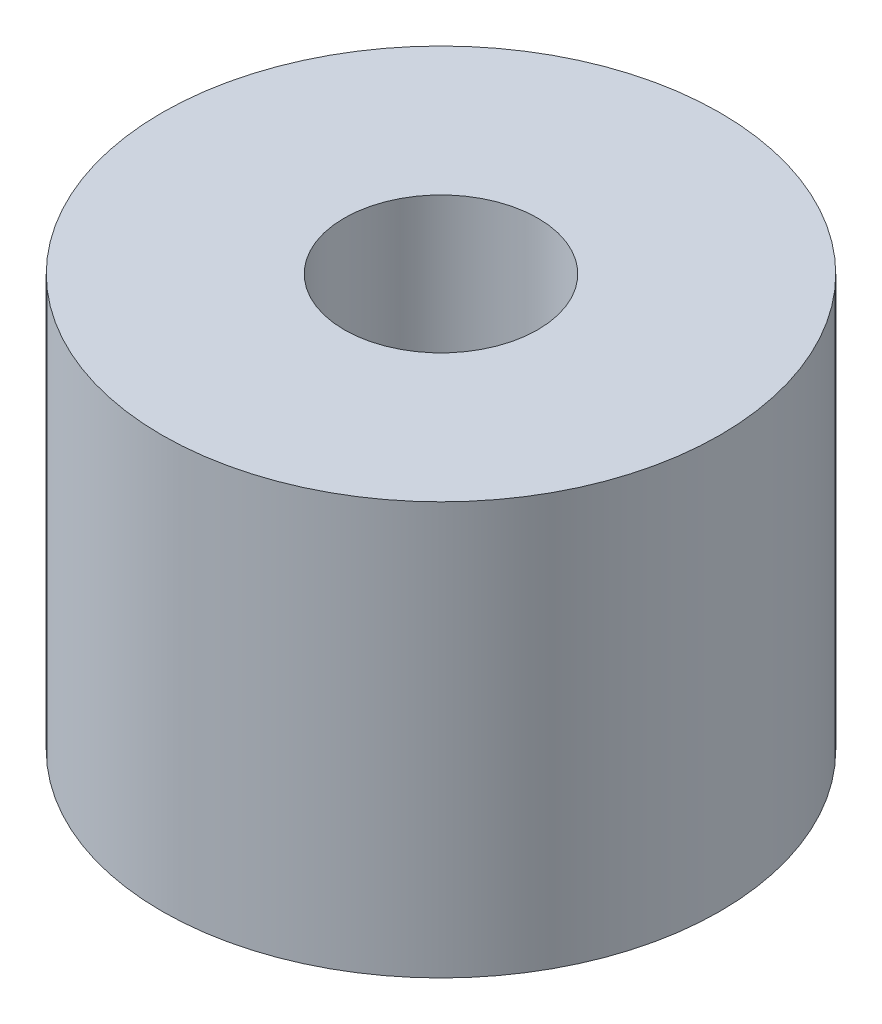
ISO-10303-21;
HEADER;
FILE_DESCRIPTION(('STEP AP214'),'2;1');
FILE_NAME('part.step','',(''),(''),'','','');
FILE_SCHEMA(('AUTOMOTIVE_DESIGN { 1 0 10303 214 1 1 1 1 }'));
ENDSEC;
DATA;
#1=APPLICATION_CONTEXT('core data for automotive mechanical design processes');
#2=APPLICATION_PROTOCOL_DEFINITION('international standard','automotive_design',2000,#1);
#3=PRODUCT_CONTEXT('',#1,'mechanical');
#4=PRODUCT('Part','Part','',(#3));
#5=PRODUCT_RELATED_PRODUCT_CATEGORY('part','',(#4));
#6=PRODUCT_DEFINITION_FORMATION('','',#4);
#7=PRODUCT_DEFINITION_CONTEXT('part definition',#1,'design');
#8=PRODUCT_DEFINITION('design','',#6,#7);
#9=PRODUCT_DEFINITION_SHAPE('','',#8);
#10=(LENGTH_UNIT() NAMED_UNIT(*) SI_UNIT(.MILLI.,.METRE.));
#11=(NAMED_UNIT(*) PLANE_ANGLE_UNIT() SI_UNIT($,.RADIAN.));
#12=(NAMED_UNIT(*) SI_UNIT($,.STERADIAN.) SOLID_ANGLE_UNIT());
#13=UNCERTAINTY_MEASURE_WITH_UNIT(LENGTH_MEASURE(1.E-05),#10,'distance_accuracy_value','');
#14=(GEOMETRIC_REPRESENTATION_CONTEXT(3) GLOBAL_UNCERTAINTY_ASSIGNED_CONTEXT((#13)) GLOBAL_UNIT_ASSIGNED_CONTEXT((#10,
#11,#12)) REPRESENTATION_CONTEXT('',''));
#15=CARTESIAN_POINT('',(0.,0.,0.));
#16=DIRECTION('',(0.,0.,1.));
#17=DIRECTION('',(1.,0.,0.));
#18=AXIS2_PLACEMENT_3D('',#15,#16,#17);
#19=CARTESIAN_POINT('',(0.,11.08,0.));
#20=DIRECTION('',(0.,1.,0.));
#21=DIRECTION('',(0.,0.,1.));
#22=AXIS2_PLACEMENT_3D('',#19,#20,#21);
#23=PLANE('',#22);
#24=CARTESIAN_POINT('',(0.,11.08,0.));
#25=DIRECTION('',(0.,1.,0.));
#26=DIRECTION('',(0.,0.,1.));
#27=AXIS2_PLACEMENT_3D('',#24,#25,#26);
#28=CIRCLE('',#27,7.5);
#29=CARTESIAN_POINT('',(0.,11.08,7.5));
#30=VERTEX_POINT('',#29);
#31=EDGE_CURVE('E10',#30,#30,#28,.T.);
#32=ORIENTED_EDGE('',*,*,#31,.T.);
#33=EDGE_LOOP('',(#32));
#34=FACE_BOUND('',#33,.T.);
#35=CARTESIAN_POINT('',(0.,11.08,0.));
#36=DIRECTION('',(0.,1.,0.));
#37=DIRECTION('',(0.,0.,1.));
#38=AXIS2_PLACEMENT_3D('',#35,#36,#37);
#39=CIRCLE('',#38,2.6);
#40=CARTESIAN_POINT('',(0.,11.08,2.6));
#41=VERTEX_POINT('',#40);
#42=EDGE_CURVE('E42',#41,#41,#39,.T.);
#43=ORIENTED_EDGE('',*,*,#42,.F.);
#44=EDGE_LOOP('',(#43));
#45=FACE_BOUND('',#44,.T.);
#46=ADVANCED_FACE('F31',(#34,#45),#23,.T.);
#47=CARTESIAN_POINT('',(0.,0.,0.));
#48=DIRECTION('',(0.,1.,0.));
#49=DIRECTION('',(0.,0.,1.));
#50=AXIS2_PLACEMENT_3D('',#47,#48,#49);
#51=PLANE('',#50);
#52=CARTESIAN_POINT('',(0.,0.,0.));
#53=DIRECTION('',(0.,1.,0.));
#54=DIRECTION('',(0.,0.,1.));
#55=AXIS2_PLACEMENT_3D('',#52,#53,#54);
#56=CIRCLE('',#55,7.5);
#57=CARTESIAN_POINT('',(0.,0.,7.5));
#58=VERTEX_POINT('',#57);
#59=EDGE_CURVE('E35',#58,#58,#56,.T.);
#60=ORIENTED_EDGE('',*,*,#59,.F.);
#61=EDGE_LOOP('',(#60));
#62=FACE_BOUND('',#61,.T.);
#63=CARTESIAN_POINT('',(0.,0.,0.));
#64=DIRECTION('',(0.,1.,0.));
#65=DIRECTION('',(0.,0.,1.));
#66=AXIS2_PLACEMENT_3D('',#63,#64,#65);
#67=CIRCLE('',#66,2.6);
#68=CARTESIAN_POINT('',(0.,0.,2.6));
#69=VERTEX_POINT('',#68);
#70=EDGE_CURVE('E44',#69,#69,#67,.T.);
#71=ORIENTED_EDGE('',*,*,#70,.T.);
#72=EDGE_LOOP('',(#71));
#73=FACE_BOUND('',#72,.T.);
#74=ADVANCED_FACE('F54',(#62,#73),#51,.F.);
#75=CARTESIAN_POINT('',(0.,11.08,0.));
#76=DIRECTION('',(0.,-1.,0.));
#77=DIRECTION('',(0.,0.,-1.));
#78=AXIS2_PLACEMENT_3D('',#75,#76,#77);
#79=CYLINDRICAL_SURFACE('',#78,7.5);
#80=ORIENTED_EDGE('',*,*,#31,.F.);
#81=EDGE_LOOP('',(#80));
#82=FACE_BOUND('',#81,.T.);
#83=ORIENTED_EDGE('',*,*,#59,.T.);
#84=EDGE_LOOP('',(#83));
#85=FACE_BOUND('',#84,.T.);
#86=ADVANCED_FACE('F33',(#82,#85),#79,.T.);
#87=CARTESIAN_POINT('',(0.,11.08,0.));
#88=DIRECTION('',(0.,-1.,0.));
#89=DIRECTION('',(0.,0.,-1.));
#90=AXIS2_PLACEMENT_3D('',#87,#88,#89);
#91=CYLINDRICAL_SURFACE('',#90,2.6);
#92=ORIENTED_EDGE('',*,*,#42,.T.);
#93=EDGE_LOOP('',(#92));
#94=FACE_BOUND('',#93,.T.);
#95=ORIENTED_EDGE('',*,*,#70,.F.);
#96=EDGE_LOOP('',(#95));
#97=FACE_BOUND('',#96,.T.);
#98=ADVANCED_FACE('F50',(#94,#97),#91,.F.);
#99=CLOSED_SHELL('',(#46,#74,#86,#98));
#100=MANIFOLD_SOLID_BREP('B2',#99);
#101=ADVANCED_BREP_SHAPE_REPRESENTATION('',(#18,#100),#14);
#102=SHAPE_DEFINITION_REPRESENTATION(#9,#101);
ENDSEC;
END-ISO-10303-21;
